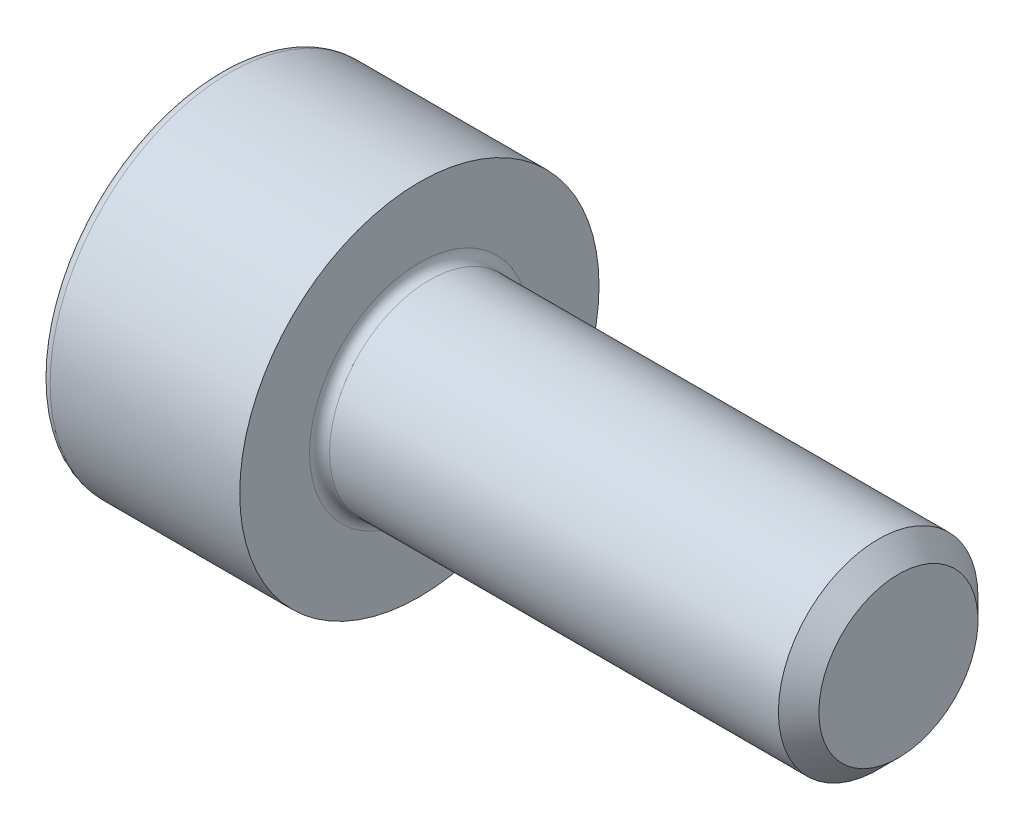
ISO-10303-21;
HEADER;
FILE_DESCRIPTION(('STEP AP214'),'2;1');
FILE_NAME('part.step','',(''),(''),'','','');
FILE_SCHEMA(('AUTOMOTIVE_DESIGN { 1 0 10303 214 1 1 1 1 }'));
ENDSEC;
DATA;
#1=APPLICATION_CONTEXT('core data for automotive mechanical design processes');
#2=APPLICATION_PROTOCOL_DEFINITION('international standard','automotive_design',2000,#1);
#3=PRODUCT_CONTEXT('',#1,'mechanical');
#4=PRODUCT('Part','Part','',(#3));
#5=PRODUCT_RELATED_PRODUCT_CATEGORY('part','',(#4));
#6=PRODUCT_DEFINITION_FORMATION('','',#4);
#7=PRODUCT_DEFINITION_CONTEXT('part definition',#1,'design');
#8=PRODUCT_DEFINITION('design','',#6,#7);
#9=PRODUCT_DEFINITION_SHAPE('','',#8);
#10=(LENGTH_UNIT() NAMED_UNIT(*) SI_UNIT(.MILLI.,.METRE.));
#11=(NAMED_UNIT(*) PLANE_ANGLE_UNIT() SI_UNIT($,.RADIAN.));
#12=(NAMED_UNIT(*) SI_UNIT($,.STERADIAN.) SOLID_ANGLE_UNIT());
#13=UNCERTAINTY_MEASURE_WITH_UNIT(LENGTH_MEASURE(1.E-05),#10,'distance_accuracy_value','');
#14=(GEOMETRIC_REPRESENTATION_CONTEXT(3) GLOBAL_UNCERTAINTY_ASSIGNED_CONTEXT((#13)) GLOBAL_UNIT_ASSIGNED_CONTEXT((#10,
#11,#12)) REPRESENTATION_CONTEXT('',''));
#15=CARTESIAN_POINT('',(0.,0.,0.));
#16=DIRECTION('',(0.,0.,1.));
#17=DIRECTION('',(1.,0.,0.));
#18=AXIS2_PLACEMENT_3D('',#15,#16,#17);
#19=CARTESIAN_POINT('',(6.,0.,0.));
#20=DIRECTION('',(-1.,0.,0.));
#21=DIRECTION('',(0.,0.,1.));
#22=AXIS2_PLACEMENT_3D('',#19,#20,#21);
#23=CONICAL_SURFACE('',#22,0.996499999993503,0.785398163397451);
#24=CARTESIAN_POINT('',(5.7464999999935,0.,0.));
#25=DIRECTION('',(-1.,0.,0.));
#26=DIRECTION('',(0.,0.,1.));
#27=AXIS2_PLACEMENT_3D('',#24,#25,#26);
#28=CIRCLE('',#27,1.25);
#29=CARTESIAN_POINT('',(5.7464999999935,0.,1.25));
#30=VERTEX_POINT('',#29);
#31=EDGE_CURVE('E11',#30,#30,#28,.T.);
#32=ORIENTED_EDGE('',*,*,#31,.F.);
#33=EDGE_LOOP('',(#32));
#34=FACE_BOUND('',#33,.T.);
#35=CARTESIAN_POINT('',(6.,0.,0.));
#36=DIRECTION('',(-1.,0.,0.));
#37=DIRECTION('',(0.,0.,1.));
#38=AXIS2_PLACEMENT_3D('',#35,#36,#37);
#39=CIRCLE('',#38,0.996499999993503);
#40=CARTESIAN_POINT('',(6.,0.,0.996499999993503));
#41=VERTEX_POINT('',#40);
#42=EDGE_CURVE('E134',#41,#41,#39,.T.);
#43=ORIENTED_EDGE('',*,*,#42,.T.);
#44=EDGE_LOOP('',(#43));
#45=FACE_BOUND('',#44,.T.);
#46=ADVANCED_FACE('F33',(#34,#45),#23,.T.);
#47=CARTESIAN_POINT('',(-2.5,0.,0.));
#48=DIRECTION('',(-1.,0.,0.));
#49=DIRECTION('',(0.,0.,1.));
#50=AXIS2_PLACEMENT_3D('',#47,#48,#49);
#51=CYLINDRICAL_SURFACE('',#50,1.25);
#52=CARTESIAN_POINT('',(0.125,0.,0.));
#53=DIRECTION('',(-1.,0.,0.));
#54=DIRECTION('',(0.,0.,1.));
#55=AXIS2_PLACEMENT_3D('',#52,#53,#54);
#56=CIRCLE('',#55,1.25);
#57=CARTESIAN_POINT('',(0.125,0.,1.25));
#58=VERTEX_POINT('',#57);
#59=EDGE_CURVE('E40',#58,#58,#56,.T.);
#60=ORIENTED_EDGE('',*,*,#59,.F.);
#61=EDGE_LOOP('',(#60));
#62=FACE_BOUND('',#61,.T.);
#63=ORIENTED_EDGE('',*,*,#31,.T.);
#64=EDGE_LOOP('',(#63));
#65=FACE_BOUND('',#64,.T.);
#66=ADVANCED_FACE('F158',(#62,#65),#51,.T.);
#67=CARTESIAN_POINT('',(0.125,0.,0.));
#68=DIRECTION('',(-1.,0.,0.));
#69=DIRECTION('',(0.,0.,1.));
#70=AXIS2_PLACEMENT_3D('',#67,#68,#69);
#71=TOROIDAL_SURFACE('',#70,1.375,0.125);
#72=CARTESIAN_POINT('',(0.,0.,0.));
#73=DIRECTION('',(-1.,0.,0.));
#74=DIRECTION('',(0.,0.,1.));
#75=AXIS2_PLACEMENT_3D('',#72,#73,#74);
#76=CIRCLE('',#75,1.375);
#77=CARTESIAN_POINT('',(0.,0.,1.375));
#78=VERTEX_POINT('',#77);
#79=EDGE_CURVE('E151',#78,#78,#76,.T.);
#80=ORIENTED_EDGE('',*,*,#79,.F.);
#81=EDGE_LOOP('',(#80));
#82=FACE_BOUND('',#81,.T.);
#83=ORIENTED_EDGE('',*,*,#59,.T.);
#84=EDGE_LOOP('',(#83));
#85=FACE_BOUND('',#84,.T.);
#86=ADVANCED_FACE('F156',(#82,#85),#71,.F.);
#87=CARTESIAN_POINT('',(0.,1.375,0.));
#88=DIRECTION('',(-1.,0.,0.));
#89=DIRECTION('',(0.,0.,1.));
#90=AXIS2_PLACEMENT_3D('',#87,#88,#89);
#91=PLANE('',#90);
#92=CARTESIAN_POINT('',(0.,0.,0.));
#93=DIRECTION('',(-1.,0.,0.));
#94=DIRECTION('',(0.,0.,1.));
#95=AXIS2_PLACEMENT_3D('',#92,#93,#94);
#96=CIRCLE('',#95,2.25);
#97=CARTESIAN_POINT('',(0.,0.,2.25));
#98=VERTEX_POINT('',#97);
#99=EDGE_CURVE('E148',#98,#98,#96,.T.);
#100=ORIENTED_EDGE('',*,*,#99,.F.);
#101=EDGE_LOOP('',(#100));
#102=FACE_BOUND('',#101,.T.);
#103=ORIENTED_EDGE('',*,*,#79,.T.);
#104=EDGE_LOOP('',(#103));
#105=FACE_BOUND('',#104,.T.);
#106=ADVANCED_FACE('F189',(#102,#105),#91,.F.);
#107=CARTESIAN_POINT('',(-2.5,0.,0.));
#108=DIRECTION('',(-1.,0.,0.));
#109=DIRECTION('',(0.,0.,1.));
#110=AXIS2_PLACEMENT_3D('',#107,#108,#109);
#111=CYLINDRICAL_SURFACE('',#110,2.25);
#112=CARTESIAN_POINT('',(-2.375,0.,0.));
#113=DIRECTION('',(-1.,0.,0.));
#114=DIRECTION('',(0.,0.,1.));
#115=AXIS2_PLACEMENT_3D('',#112,#113,#114);
#116=CIRCLE('',#115,2.25);
#117=CARTESIAN_POINT('',(-2.375,0.,2.25));
#118=VERTEX_POINT('',#117);
#119=EDGE_CURVE('E145',#118,#118,#116,.T.);
#120=ORIENTED_EDGE('',*,*,#119,.F.);
#121=EDGE_LOOP('',(#120));
#122=FACE_BOUND('',#121,.T.);
#123=ORIENTED_EDGE('',*,*,#99,.T.);
#124=EDGE_LOOP('',(#123));
#125=FACE_BOUND('',#124,.T.);
#126=ADVANCED_FACE('F185',(#122,#125),#111,.T.);
#127=CARTESIAN_POINT('',(-2.375,0.,0.));
#128=DIRECTION('',(-1.,0.,0.));
#129=DIRECTION('',(0.,0.,1.));
#130=AXIS2_PLACEMENT_3D('',#127,#128,#129);
#131=TOROIDAL_SURFACE('',#130,2.125,0.125);
#132=CARTESIAN_POINT('',(-2.5,0.,0.));
#133=DIRECTION('',(-1.,0.,0.));
#134=DIRECTION('',(0.,0.,1.));
#135=AXIS2_PLACEMENT_3D('',#132,#133,#134);
#136=CIRCLE('',#135,2.125);
#137=CARTESIAN_POINT('',(-2.5,0.,2.125));
#138=VERTEX_POINT('',#137);
#139=EDGE_CURVE('E142',#138,#138,#136,.T.);
#140=ORIENTED_EDGE('',*,*,#139,.F.);
#141=EDGE_LOOP('',(#140));
#142=FACE_BOUND('',#141,.T.);
#143=ORIENTED_EDGE('',*,*,#119,.T.);
#144=EDGE_LOOP('',(#143));
#145=FACE_BOUND('',#144,.T.);
#146=ADVANCED_FACE('F178',(#142,#145),#131,.T.);
#147=CARTESIAN_POINT('',(-2.5,2.125,0.));
#148=DIRECTION('',(1.,0.,0.));
#149=DIRECTION('',(0.,0.,-1.));
#150=AXIS2_PLACEMENT_3D('',#147,#148,#149);
#151=PLANE('',#150);
#152=DIRECTION('',(0.,0.5,-0.866025403784438));
#153=VECTOR('',#152,1.);
#154=CARTESIAN_POINT('',(-2.5,0.591784025919366,1.025));
#155=LINE('',#154,#153);
#156=CARTESIAN_POINT('',(-2.5,0.591784025919366,1.025));
#157=VERTEX_POINT('',#156);
#158=CARTESIAN_POINT('',(-2.5,1.18356805183873,0.));
#159=VERTEX_POINT('',#158);
#160=EDGE_CURVE('E121',#157,#159,#155,.T.);
#161=ORIENTED_EDGE('',*,*,#160,.F.);
#162=DIRECTION('',(0.,1.,0.));
#163=VECTOR('',#162,1.);
#164=CARTESIAN_POINT('',(-2.5,-0.591784025919367,1.025));
#165=LINE('',#164,#163);
#166=CARTESIAN_POINT('',(-2.5,-0.591784025919367,1.025));
#167=VERTEX_POINT('',#166);
#168=EDGE_CURVE('E47',#167,#157,#165,.T.);
#169=ORIENTED_EDGE('',*,*,#168,.F.);
#170=DIRECTION('',(0.,0.5,0.866025403784439));
#171=VECTOR('',#170,1.);
#172=CARTESIAN_POINT('',(-2.5,-1.18356805183873,0.));
#173=LINE('',#172,#171);
#174=CARTESIAN_POINT('',(-2.5,-1.18356805183873,0.));
#175=VERTEX_POINT('',#174);
#176=EDGE_CURVE('E130',#175,#167,#173,.T.);
#177=ORIENTED_EDGE('',*,*,#176,.F.);
#178=DIRECTION('',(0.,-0.5,0.866025403784438));
#179=VECTOR('',#178,1.);
#180=CARTESIAN_POINT('',(-2.5,-0.591784025919366,-1.025));
#181=LINE('',#180,#179);
#182=CARTESIAN_POINT('',(-2.5,-0.591784025919366,-1.025));
#183=VERTEX_POINT('',#182);
#184=EDGE_CURVE('E128',#183,#175,#181,.T.);
#185=ORIENTED_EDGE('',*,*,#184,.F.);
#186=DIRECTION('',(0.,-1.,0.));
#187=VECTOR('',#186,1.);
#188=CARTESIAN_POINT('',(-2.5,0.591784025919367,-1.025));
#189=LINE('',#188,#187);
#190=CARTESIAN_POINT('',(-2.5,0.591784025919367,-1.025));
#191=VERTEX_POINT('',#190);
#192=EDGE_CURVE('E95',#191,#183,#189,.T.);
#193=ORIENTED_EDGE('',*,*,#192,.F.);
#194=DIRECTION('',(0.,-0.5,-0.866025403784439));
#195=VECTOR('',#194,1.);
#196=CARTESIAN_POINT('',(-2.5,1.18356805183873,0.));
#197=LINE('',#196,#195);
#198=EDGE_CURVE('E124',#159,#191,#197,.T.);
#199=ORIENTED_EDGE('',*,*,#198,.F.);
#200=EDGE_LOOP('',(#161,#169,#177,#185,#193,#199));
#201=FACE_BOUND('',#200,.T.);
#202=ORIENTED_EDGE('',*,*,#139,.T.);
#203=EDGE_LOOP('',(#202));
#204=FACE_BOUND('',#203,.T.);
#205=ADVANCED_FACE('F170',(#201,#204),#151,.F.);
#206=CARTESIAN_POINT('',(6.,0.996499999993503,0.));
#207=DIRECTION('',(-1.,0.,0.));
#208=DIRECTION('',(0.,0.,1.));
#209=AXIS2_PLACEMENT_3D('',#206,#207,#208);
#210=PLANE('',#209);
#211=ORIENTED_EDGE('',*,*,#42,.F.);
#212=EDGE_LOOP('',(#211));
#213=FACE_BOUND('',#212,.T.);
#214=ADVANCED_FACE('F167',(#213),#210,.F.);
#215=CARTESIAN_POINT('',(-1.4,-0.591784025919367,1.025));
#216=DIRECTION('',(0.,0.,1.));
#217=DIRECTION('',(1.,0.,0.));
#218=AXIS2_PLACEMENT_3D('',#215,#216,#217);
#219=PLANE('',#218);
#220=ORIENTED_EDGE('',*,*,#168,.T.);
#221=DIRECTION('',(-1.,0.,0.));
#222=VECTOR('',#221,1.);
#223=CARTESIAN_POINT('',(-1.4,0.591784025919366,1.025));
#224=LINE('',#223,#222);
#225=CARTESIAN_POINT('',(-1.4,0.591784025919366,1.025));
#226=VERTEX_POINT('',#225);
#227=EDGE_CURVE('E77',#226,#157,#224,.T.);
#228=ORIENTED_EDGE('',*,*,#227,.F.);
#229=DIRECTION('',(0.,1.,0.));
#230=VECTOR('',#229,1.);
#231=CARTESIAN_POINT('',(-1.4,-0.591784025919367,1.025));
#232=LINE('',#231,#230);
#233=CARTESIAN_POINT('',(-1.4,-0.591784025919367,1.025));
#234=VERTEX_POINT('',#233);
#235=EDGE_CURVE('E132',#234,#226,#232,.T.);
#236=ORIENTED_EDGE('',*,*,#235,.F.);
#237=DIRECTION('',(-1.,0.,0.));
#238=VECTOR('',#237,1.);
#239=CARTESIAN_POINT('',(-1.4,-0.591784025919367,1.025));
#240=LINE('',#239,#238);
#241=EDGE_CURVE('E55',#234,#167,#240,.T.);
#242=ORIENTED_EDGE('',*,*,#241,.T.);
#243=EDGE_LOOP('',(#220,#228,#236,#242));
#244=FACE_BOUND('',#243,.T.);
#245=ADVANCED_FACE('F169',(#244),#219,.F.);
#246=CARTESIAN_POINT('',(-1.4,-1.18356805183873,0.));
#247=DIRECTION('',(0.,-0.866025403784439,0.5));
#248=DIRECTION('',(0.,-0.5,-0.866025403784439));
#249=AXIS2_PLACEMENT_3D('',#246,#247,#248);
#250=PLANE('',#249);
#251=ORIENTED_EDGE('',*,*,#176,.T.);
#252=ORIENTED_EDGE('',*,*,#241,.F.);
#253=DIRECTION('',(0.,0.5,0.866025403784439));
#254=VECTOR('',#253,1.);
#255=CARTESIAN_POINT('',(-1.4,-1.18356805183873,0.));
#256=LINE('',#255,#254);
#257=CARTESIAN_POINT('',(-1.4,-1.18356805183873,0.));
#258=VERTEX_POINT('',#257);
#259=EDGE_CURVE('E107',#258,#234,#256,.T.);
#260=ORIENTED_EDGE('',*,*,#259,.F.);
#261=DIRECTION('',(-1.,0.,0.));
#262=VECTOR('',#261,1.);
#263=CARTESIAN_POINT('',(-1.4,-1.18356805183873,0.));
#264=LINE('',#263,#262);
#265=EDGE_CURVE('E99',#258,#175,#264,.T.);
#266=ORIENTED_EDGE('',*,*,#265,.T.);
#267=EDGE_LOOP('',(#251,#252,#260,#266));
#268=FACE_BOUND('',#267,.T.);
#269=ADVANCED_FACE('F176',(#268),#250,.F.);
#270=CARTESIAN_POINT('',(-1.4,-0.591784025919366,-1.025));
#271=DIRECTION('',(0.,-0.866025403784439,-0.5));
#272=DIRECTION('',(0.,0.5,-0.866025403784438));
#273=AXIS2_PLACEMENT_3D('',#270,#271,#272);
#274=PLANE('',#273);
#275=ORIENTED_EDGE('',*,*,#184,.T.);
#276=ORIENTED_EDGE('',*,*,#265,.F.);
#277=DIRECTION('',(0.,-0.5,0.866025403784438));
#278=VECTOR('',#277,1.);
#279=CARTESIAN_POINT('',(-1.4,-0.591784025919366,-1.025));
#280=LINE('',#279,#278);
#281=CARTESIAN_POINT('',(-1.4,-0.591784025919366,-1.025));
#282=VERTEX_POINT('',#281);
#283=EDGE_CURVE('E103',#282,#258,#280,.T.);
#284=ORIENTED_EDGE('',*,*,#283,.F.);
#285=DIRECTION('',(-1.,0.,0.));
#286=VECTOR('',#285,1.);
#287=CARTESIAN_POINT('',(-1.4,-0.591784025919366,-1.025));
#288=LINE('',#287,#286);
#289=EDGE_CURVE('E88',#282,#183,#288,.T.);
#290=ORIENTED_EDGE('',*,*,#289,.T.);
#291=EDGE_LOOP('',(#275,#276,#284,#290));
#292=FACE_BOUND('',#291,.T.);
#293=ADVANCED_FACE('F104',(#292),#274,.F.);
#294=CARTESIAN_POINT('',(-1.4,0.591784025919367,-1.025));
#295=DIRECTION('',(0.,0.,-1.));
#296=DIRECTION('',(-1.,0.,0.));
#297=AXIS2_PLACEMENT_3D('',#294,#295,#296);
#298=PLANE('',#297);
#299=ORIENTED_EDGE('',*,*,#192,.T.);
#300=ORIENTED_EDGE('',*,*,#289,.F.);
#301=DIRECTION('',(0.,-1.,0.));
#302=VECTOR('',#301,1.);
#303=CARTESIAN_POINT('',(-1.4,0.591784025919367,-1.025));
#304=LINE('',#303,#302);
#305=CARTESIAN_POINT('',(-1.4,0.591784025919367,-1.025));
#306=VERTEX_POINT('',#305);
#307=EDGE_CURVE('E92',#306,#282,#304,.T.);
#308=ORIENTED_EDGE('',*,*,#307,.F.);
#309=DIRECTION('',(-1.,0.,0.));
#310=VECTOR('',#309,1.);
#311=CARTESIAN_POINT('',(-1.4,0.591784025919367,-1.025));
#312=LINE('',#311,#310);
#313=EDGE_CURVE('E100',#306,#191,#312,.T.);
#314=ORIENTED_EDGE('',*,*,#313,.T.);
#315=EDGE_LOOP('',(#299,#300,#308,#314));
#316=FACE_BOUND('',#315,.T.);
#317=ADVANCED_FACE('F90',(#316),#298,.F.);
#318=CARTESIAN_POINT('',(-1.4,1.18356805183873,0.));
#319=DIRECTION('',(0.,0.866025403784439,-0.5));
#320=DIRECTION('',(0.,0.5,0.866025403784439));
#321=AXIS2_PLACEMENT_3D('',#318,#319,#320);
#322=PLANE('',#321);
#323=ORIENTED_EDGE('',*,*,#198,.T.);
#324=ORIENTED_EDGE('',*,*,#313,.F.);
#325=DIRECTION('',(0.,-0.5,-0.866025403784439));
#326=VECTOR('',#325,1.);
#327=CARTESIAN_POINT('',(-1.4,1.18356805183873,0.));
#328=LINE('',#327,#326);
#329=CARTESIAN_POINT('',(-1.4,1.18356805183873,0.));
#330=VERTEX_POINT('',#329);
#331=EDGE_CURVE('E113',#330,#306,#328,.T.);
#332=ORIENTED_EDGE('',*,*,#331,.F.);
#333=DIRECTION('',(-1.,0.,0.));
#334=VECTOR('',#333,1.);
#335=CARTESIAN_POINT('',(-1.4,1.18356805183873,0.));
#336=LINE('',#335,#334);
#337=EDGE_CURVE('E137',#330,#159,#336,.T.);
#338=ORIENTED_EDGE('',*,*,#337,.T.);
#339=EDGE_LOOP('',(#323,#324,#332,#338));
#340=FACE_BOUND('',#339,.T.);
#341=ADVANCED_FACE('F251',(#340),#322,.F.);
#342=CARTESIAN_POINT('',(-1.4,0.591784025919366,1.025));
#343=DIRECTION('',(0.,0.866025403784439,0.5));
#344=DIRECTION('',(0.,-0.5,0.866025403784438));
#345=AXIS2_PLACEMENT_3D('',#342,#343,#344);
#346=PLANE('',#345);
#347=ORIENTED_EDGE('',*,*,#160,.T.);
#348=ORIENTED_EDGE('',*,*,#337,.F.);
#349=DIRECTION('',(0.,0.5,-0.866025403784438));
#350=VECTOR('',#349,1.);
#351=CARTESIAN_POINT('',(-1.4,0.591784025919366,1.025));
#352=LINE('',#351,#350);
#353=EDGE_CURVE('E115',#226,#330,#352,.T.);
#354=ORIENTED_EDGE('',*,*,#353,.F.);
#355=ORIENTED_EDGE('',*,*,#227,.T.);
#356=EDGE_LOOP('',(#347,#348,#354,#355));
#357=FACE_BOUND('',#356,.T.);
#358=ADVANCED_FACE('F260',(#357),#346,.F.);
#359=CARTESIAN_POINT('',(-1.4,0.,0.));
#360=DIRECTION('',(-1.,0.,0.));
#361=DIRECTION('',(0.,0.,1.));
#362=AXIS2_PLACEMENT_3D('',#359,#360,#361);
#363=PLANE('',#362);
#364=ORIENTED_EDGE('',*,*,#235,.T.);
#365=ORIENTED_EDGE('',*,*,#353,.T.);
#366=ORIENTED_EDGE('',*,*,#331,.T.);
#367=ORIENTED_EDGE('',*,*,#307,.T.);
#368=ORIENTED_EDGE('',*,*,#283,.T.);
#369=ORIENTED_EDGE('',*,*,#259,.T.);
#370=EDGE_LOOP('',(#364,#365,#366,#367,#368,#369));
#371=FACE_BOUND('',#370,.T.);
#372=ADVANCED_FACE('F110',(#371),#363,.T.);
#373=CLOSED_SHELL('',(#46,#66,#86,#106,#126,#146,#205,#214,#245,#269,#293,#317,#341,#358,#372));
#374=MANIFOLD_SOLID_BREP('B2',#373);
#375=ADVANCED_BREP_SHAPE_REPRESENTATION('',(#18,#374),#14);
#376=SHAPE_DEFINITION_REPRESENTATION(#9,#375);
ENDSEC;
END-ISO-10303-21;
